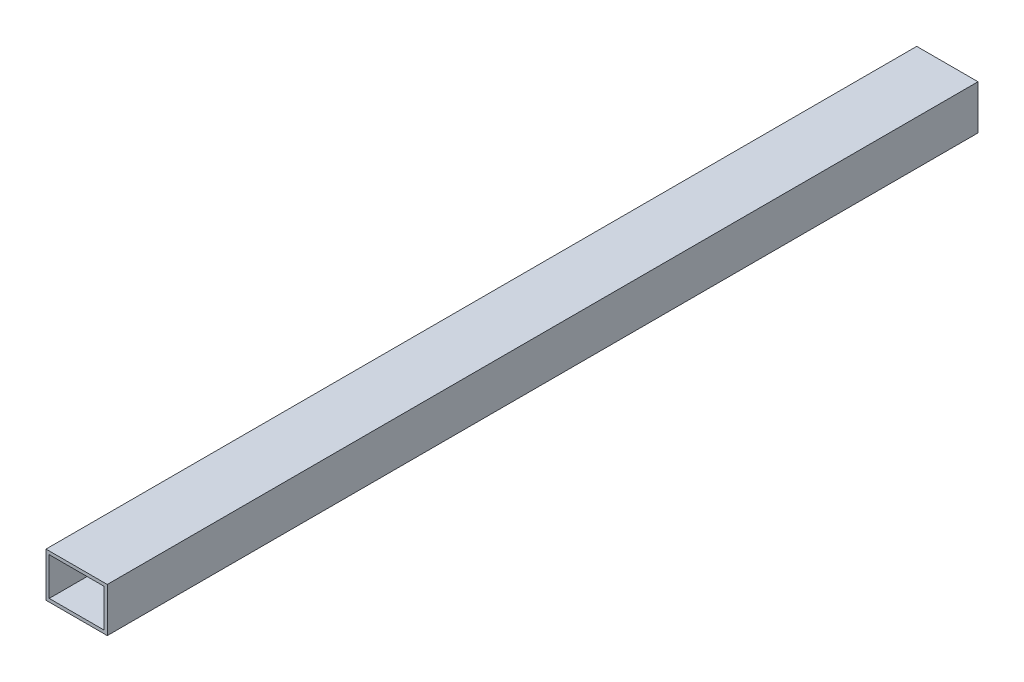
ISO-10303-21;
HEADER;
FILE_DESCRIPTION(('STEP AP214'),'2;1');
FILE_NAME('part.step','',(''),(''),'','','');
FILE_SCHEMA(('AUTOMOTIVE_DESIGN { 1 0 10303 214 1 1 1 1 }'));
ENDSEC;
DATA;
#1=APPLICATION_CONTEXT('core data for automotive mechanical design processes');
#2=APPLICATION_PROTOCOL_DEFINITION('international standard','automotive_design',2000,#1);
#3=PRODUCT_CONTEXT('',#1,'mechanical');
#4=PRODUCT('Part','Part','',(#3));
#5=PRODUCT_RELATED_PRODUCT_CATEGORY('part','',(#4));
#6=PRODUCT_DEFINITION_FORMATION('','',#4);
#7=PRODUCT_DEFINITION_CONTEXT('part definition',#1,'design');
#8=PRODUCT_DEFINITION('design','',#6,#7);
#9=PRODUCT_DEFINITION_SHAPE('','',#8);
#10=(LENGTH_UNIT() NAMED_UNIT(*) SI_UNIT(.MILLI.,.METRE.));
#11=(NAMED_UNIT(*) PLANE_ANGLE_UNIT() SI_UNIT($,.RADIAN.));
#12=(NAMED_UNIT(*) SI_UNIT($,.STERADIAN.) SOLID_ANGLE_UNIT());
#13=UNCERTAINTY_MEASURE_WITH_UNIT(LENGTH_MEASURE(1.E-05),#10,'distance_accuracy_value','');
#14=(GEOMETRIC_REPRESENTATION_CONTEXT(3) GLOBAL_UNCERTAINTY_ASSIGNED_CONTEXT((#13)) GLOBAL_UNIT_ASSIGNED_CONTEXT((#10,
#11,#12)) REPRESENTATION_CONTEXT('',''));
#15=CARTESIAN_POINT('',(0.,0.,0.));
#16=DIRECTION('',(0.,0.,1.));
#17=DIRECTION('',(1.,0.,0.));
#18=AXIS2_PLACEMENT_3D('',#15,#16,#17);
#19=CARTESIAN_POINT('',(0.,0.,540.));
#20=DIRECTION('',(0.,0.,1.));
#21=DIRECTION('',(1.,0.,0.));
#22=AXIS2_PLACEMENT_3D('',#19,#20,#21);
#23=PLANE('',#22);
#24=DIRECTION('',(0.,-1.,0.));
#25=VECTOR('',#24,1.);
#26=CARTESIAN_POINT('',(-34.9065842427437,29.0670168797834,540.));
#27=LINE('',#26,#25);
#28=CARTESIAN_POINT('',(-34.9065842427437,29.0670168797834,540.));
#29=VERTEX_POINT('',#28);
#30=CARTESIAN_POINT('',(-34.9065842427437,1.56701687978338,540.));
#31=VERTEX_POINT('',#30);
#32=EDGE_CURVE('E153',#29,#31,#27,.T.);
#33=ORIENTED_EDGE('',*,*,#32,.T.);
#34=DIRECTION('',(1.,0.,0.));
#35=VECTOR('',#34,1.);
#36=CARTESIAN_POINT('',(-34.9065842427437,1.56701687978338,540.));
#37=LINE('',#36,#35);
#38=CARTESIAN_POINT('',(3.09341575725631,1.56701687978338,540.));
#39=VERTEX_POINT('',#38);
#40=EDGE_CURVE('E157',#31,#39,#37,.T.);
#41=ORIENTED_EDGE('',*,*,#40,.T.);
#42=DIRECTION('',(0.,1.,0.));
#43=VECTOR('',#42,1.);
#44=CARTESIAN_POINT('',(3.0934157572563,29.0670168797834,540.));
#45=LINE('',#44,#43);
#46=CARTESIAN_POINT('',(3.0934157572563,29.0670168797834,540.));
#47=VERTEX_POINT('',#46);
#48=EDGE_CURVE('E161',#39,#47,#45,.T.);
#49=ORIENTED_EDGE('',*,*,#48,.T.);
#50=DIRECTION('',(-1.,0.,0.));
#51=VECTOR('',#50,1.);
#52=CARTESIAN_POINT('',(-34.9065842427437,29.0670168797834,540.));
#53=LINE('',#52,#51);
#54=EDGE_CURVE('E164',#47,#29,#53,.T.);
#55=ORIENTED_EDGE('',*,*,#54,.T.);
#56=EDGE_LOOP('',(#33,#41,#49,#55));
#57=FACE_BOUND('',#56,.T.);
#58=DIRECTION('',(1.,0.,0.));
#59=VECTOR('',#58,1.);
#60=CARTESIAN_POINT('',(-32.9065842427437,3.56701687978338,540.));
#61=LINE('',#60,#59);
#62=CARTESIAN_POINT('',(-32.9065842427437,3.56701687978338,540.));
#63=VERTEX_POINT('',#62);
#64=CARTESIAN_POINT('',(1.09341575725631,3.56701687978338,540.));
#65=VERTEX_POINT('',#64);
#66=EDGE_CURVE('E114',#63,#65,#61,.T.);
#67=ORIENTED_EDGE('',*,*,#66,.F.);
#68=DIRECTION('',(0.,-1.,0.));
#69=VECTOR('',#68,1.);
#70=CARTESIAN_POINT('',(-32.9065842427437,27.0670168797834,540.));
#71=LINE('',#70,#69);
#72=CARTESIAN_POINT('',(-32.9065842427437,27.0670168797834,540.));
#73=VERTEX_POINT('',#72);
#74=EDGE_CURVE('E105',#73,#63,#71,.T.);
#75=ORIENTED_EDGE('',*,*,#74,.F.);
#76=DIRECTION('',(-1.,0.,0.));
#77=VECTOR('',#76,1.);
#78=CARTESIAN_POINT('',(-32.9065842427437,27.0670168797834,540.));
#79=LINE('',#78,#77);
#80=CARTESIAN_POINT('',(1.09341575725631,27.0670168797834,540.));
#81=VERTEX_POINT('',#80);
#82=EDGE_CURVE('E131',#81,#73,#79,.T.);
#83=ORIENTED_EDGE('',*,*,#82,.F.);
#84=DIRECTION('',(0.,1.,0.));
#85=VECTOR('',#84,1.);
#86=CARTESIAN_POINT('',(1.09341575725631,27.0670168797834,540.));
#87=LINE('',#86,#85);
#88=EDGE_CURVE('E127',#65,#81,#87,.T.);
#89=ORIENTED_EDGE('',*,*,#88,.F.);
#90=EDGE_LOOP('',(#67,#75,#83,#89));
#91=FACE_BOUND('',#90,.T.);
#92=ADVANCED_FACE('F39',(#57,#91),#23,.T.);
#93=CARTESIAN_POINT('',(0.,0.,0.));
#94=DIRECTION('',(0.,0.,1.));
#95=DIRECTION('',(1.,0.,0.));
#96=AXIS2_PLACEMENT_3D('',#93,#94,#95);
#97=PLANE('',#96);
#98=DIRECTION('',(0.,-1.,0.));
#99=VECTOR('',#98,1.);
#100=CARTESIAN_POINT('',(-34.9065842427437,29.0670168797834,0.));
#101=LINE('',#100,#99);
#102=CARTESIAN_POINT('',(-34.9065842427437,29.0670168797834,0.));
#103=VERTEX_POINT('',#102);
#104=CARTESIAN_POINT('',(-34.9065842427437,1.56701687978338,0.));
#105=VERTEX_POINT('',#104);
#106=EDGE_CURVE('E123',#103,#105,#101,.T.);
#107=ORIENTED_EDGE('',*,*,#106,.F.);
#108=DIRECTION('',(-1.,0.,0.));
#109=VECTOR('',#108,1.);
#110=CARTESIAN_POINT('',(-34.9065842427437,29.0670168797834,0.));
#111=LINE('',#110,#109);
#112=CARTESIAN_POINT('',(3.0934157572563,29.0670168797834,0.));
#113=VERTEX_POINT('',#112);
#114=EDGE_CURVE('E158',#113,#103,#111,.T.);
#115=ORIENTED_EDGE('',*,*,#114,.F.);
#116=DIRECTION('',(0.,1.,0.));
#117=VECTOR('',#116,1.);
#118=CARTESIAN_POINT('',(3.0934157572563,29.0670168797834,0.));
#119=LINE('',#118,#117);
#120=CARTESIAN_POINT('',(3.09341575725631,1.56701687978338,0.));
#121=VERTEX_POINT('',#120);
#122=EDGE_CURVE('E174',#121,#113,#119,.T.);
#123=ORIENTED_EDGE('',*,*,#122,.F.);
#124=DIRECTION('',(1.,0.,0.));
#125=VECTOR('',#124,1.);
#126=CARTESIAN_POINT('',(-34.9065842427437,1.56701687978338,0.));
#127=LINE('',#126,#125);
#128=EDGE_CURVE('E171',#105,#121,#127,.T.);
#129=ORIENTED_EDGE('',*,*,#128,.F.);
#130=EDGE_LOOP('',(#107,#115,#123,#129));
#131=FACE_BOUND('',#130,.T.);
#132=DIRECTION('',(0.,-1.,0.));
#133=VECTOR('',#132,1.);
#134=CARTESIAN_POINT('',(-32.9065842427437,27.0670168797834,0.));
#135=LINE('',#134,#133);
#136=CARTESIAN_POINT('',(-32.9065842427437,27.0670168797834,0.));
#137=VERTEX_POINT('',#136);
#138=CARTESIAN_POINT('',(-32.9065842427437,3.56701687978338,0.));
#139=VERTEX_POINT('',#138);
#140=EDGE_CURVE('E63',#137,#139,#135,.T.);
#141=ORIENTED_EDGE('',*,*,#140,.T.);
#142=DIRECTION('',(1.,0.,0.));
#143=VECTOR('',#142,1.);
#144=CARTESIAN_POINT('',(-32.9065842427437,3.56701687978338,0.));
#145=LINE('',#144,#143);
#146=CARTESIAN_POINT('',(1.09341575725631,3.56701687978338,0.));
#147=VERTEX_POINT('',#146);
#148=EDGE_CURVE('E121',#139,#147,#145,.T.);
#149=ORIENTED_EDGE('',*,*,#148,.T.);
#150=DIRECTION('',(0.,1.,0.));
#151=VECTOR('',#150,1.);
#152=CARTESIAN_POINT('',(1.09341575725631,27.0670168797834,0.));
#153=LINE('',#152,#151);
#154=CARTESIAN_POINT('',(1.09341575725631,27.0670168797834,0.));
#155=VERTEX_POINT('',#154);
#156=EDGE_CURVE('E140',#147,#155,#153,.T.);
#157=ORIENTED_EDGE('',*,*,#156,.T.);
#158=DIRECTION('',(-1.,0.,0.));
#159=VECTOR('',#158,1.);
#160=CARTESIAN_POINT('',(-32.9065842427437,27.0670168797834,0.));
#161=LINE('',#160,#159);
#162=EDGE_CURVE('E115',#155,#137,#161,.T.);
#163=ORIENTED_EDGE('',*,*,#162,.T.);
#164=EDGE_LOOP('',(#141,#149,#157,#163));
#165=FACE_BOUND('',#164,.T.);
#166=ADVANCED_FACE('F197',(#131,#165),#97,.F.);
#167=CARTESIAN_POINT('',(-34.9065842427437,29.0670168797834,540.));
#168=DIRECTION('',(1.,0.,0.));
#169=DIRECTION('',(0.,0.,-1.));
#170=AXIS2_PLACEMENT_3D('',#167,#168,#169);
#171=PLANE('',#170);
#172=ORIENTED_EDGE('',*,*,#106,.T.);
#173=DIRECTION('',(0.,0.,-1.));
#174=VECTOR('',#173,1.);
#175=CARTESIAN_POINT('',(-34.9065842427437,1.56701687978338,540.));
#176=LINE('',#175,#174);
#177=EDGE_CURVE('E11',#31,#105,#176,.T.);
#178=ORIENTED_EDGE('',*,*,#177,.F.);
#179=ORIENTED_EDGE('',*,*,#32,.F.);
#180=DIRECTION('',(0.,0.,-1.));
#181=VECTOR('',#180,1.);
#182=CARTESIAN_POINT('',(-34.9065842427437,29.0670168797834,540.));
#183=LINE('',#182,#181);
#184=EDGE_CURVE('E167',#29,#103,#183,.T.);
#185=ORIENTED_EDGE('',*,*,#184,.T.);
#186=EDGE_LOOP('',(#172,#178,#179,#185));
#187=FACE_BOUND('',#186,.T.);
#188=ADVANCED_FACE('F41',(#187),#171,.F.);
#189=CARTESIAN_POINT('',(-34.9065842427437,1.56701687978338,540.));
#190=DIRECTION('',(0.,1.,0.));
#191=DIRECTION('',(-1.,0.,0.));
#192=AXIS2_PLACEMENT_3D('',#189,#190,#191);
#193=PLANE('',#192);
#194=ORIENTED_EDGE('',*,*,#128,.T.);
#195=DIRECTION('',(0.,0.,-1.));
#196=VECTOR('',#195,1.);
#197=CARTESIAN_POINT('',(3.09341575725631,1.56701687978338,540.));
#198=LINE('',#197,#196);
#199=EDGE_CURVE('E48',#39,#121,#198,.T.);
#200=ORIENTED_EDGE('',*,*,#199,.F.);
#201=ORIENTED_EDGE('',*,*,#40,.F.);
#202=ORIENTED_EDGE('',*,*,#177,.T.);
#203=EDGE_LOOP('',(#194,#200,#201,#202));
#204=FACE_BOUND('',#203,.T.);
#205=ADVANCED_FACE('F207',(#204),#193,.F.);
#206=CARTESIAN_POINT('',(3.0934157572563,29.0670168797834,540.));
#207=DIRECTION('',(-1.,0.,0.));
#208=DIRECTION('',(0.,-1.,0.));
#209=AXIS2_PLACEMENT_3D('',#206,#207,#208);
#210=PLANE('',#209);
#211=ORIENTED_EDGE('',*,*,#122,.T.);
#212=DIRECTION('',(0.,0.,-1.));
#213=VECTOR('',#212,1.);
#214=CARTESIAN_POINT('',(3.0934157572563,29.0670168797834,540.));
#215=LINE('',#214,#213);
#216=EDGE_CURVE('E182',#47,#113,#215,.T.);
#217=ORIENTED_EDGE('',*,*,#216,.F.);
#218=ORIENTED_EDGE('',*,*,#48,.F.);
#219=ORIENTED_EDGE('',*,*,#199,.T.);
#220=EDGE_LOOP('',(#211,#217,#218,#219));
#221=FACE_BOUND('',#220,.T.);
#222=ADVANCED_FACE('F191',(#221),#210,.F.);
#223=CARTESIAN_POINT('',(-34.9065842427437,29.0670168797834,540.));
#224=DIRECTION('',(0.,-1.,0.));
#225=DIRECTION('',(1.,0.,0.));
#226=AXIS2_PLACEMENT_3D('',#223,#224,#225);
#227=PLANE('',#226);
#228=ORIENTED_EDGE('',*,*,#114,.T.);
#229=ORIENTED_EDGE('',*,*,#184,.F.);
#230=ORIENTED_EDGE('',*,*,#54,.F.);
#231=ORIENTED_EDGE('',*,*,#216,.T.);
#232=EDGE_LOOP('',(#228,#229,#230,#231));
#233=FACE_BOUND('',#232,.T.);
#234=ADVANCED_FACE('F201',(#233),#227,.F.);
#235=CARTESIAN_POINT('',(-32.9065842427437,27.0670168797834,540.));
#236=DIRECTION('',(1.,0.,0.));
#237=DIRECTION('',(0.,0.,-1.));
#238=AXIS2_PLACEMENT_3D('',#235,#236,#237);
#239=PLANE('',#238);
#240=ORIENTED_EDGE('',*,*,#140,.F.);
#241=DIRECTION('',(0.,0.,-1.));
#242=VECTOR('',#241,1.);
#243=CARTESIAN_POINT('',(-32.9065842427437,27.0670168797834,540.));
#244=LINE('',#243,#242);
#245=EDGE_CURVE('E109',#73,#137,#244,.T.);
#246=ORIENTED_EDGE('',*,*,#245,.F.);
#247=ORIENTED_EDGE('',*,*,#74,.T.);
#248=DIRECTION('',(0.,0.,-1.));
#249=VECTOR('',#248,1.);
#250=CARTESIAN_POINT('',(-32.9065842427437,3.56701687978338,540.));
#251=LINE('',#250,#249);
#252=EDGE_CURVE('E108',#63,#139,#251,.T.);
#253=ORIENTED_EDGE('',*,*,#252,.T.);
#254=EDGE_LOOP('',(#240,#246,#247,#253));
#255=FACE_BOUND('',#254,.T.);
#256=ADVANCED_FACE('F107',(#255),#239,.T.);
#257=CARTESIAN_POINT('',(-32.9065842427437,3.56701687978338,540.));
#258=DIRECTION('',(0.,1.,0.));
#259=DIRECTION('',(0.,0.,1.));
#260=AXIS2_PLACEMENT_3D('',#257,#258,#259);
#261=PLANE('',#260);
#262=ORIENTED_EDGE('',*,*,#148,.F.);
#263=ORIENTED_EDGE('',*,*,#252,.F.);
#264=ORIENTED_EDGE('',*,*,#66,.T.);
#265=DIRECTION('',(0.,0.,-1.));
#266=VECTOR('',#265,1.);
#267=CARTESIAN_POINT('',(1.09341575725631,3.56701687978338,540.));
#268=LINE('',#267,#266);
#269=EDGE_CURVE('E124',#65,#147,#268,.T.);
#270=ORIENTED_EDGE('',*,*,#269,.T.);
#271=EDGE_LOOP('',(#262,#263,#264,#270));
#272=FACE_BOUND('',#271,.T.);
#273=ADVANCED_FACE('F118',(#272),#261,.T.);
#274=CARTESIAN_POINT('',(1.09341575725631,27.0670168797834,540.));
#275=DIRECTION('',(-1.,0.,0.));
#276=DIRECTION('',(0.,-1.,0.));
#277=AXIS2_PLACEMENT_3D('',#274,#275,#276);
#278=PLANE('',#277);
#279=ORIENTED_EDGE('',*,*,#156,.F.);
#280=ORIENTED_EDGE('',*,*,#269,.F.);
#281=ORIENTED_EDGE('',*,*,#88,.T.);
#282=DIRECTION('',(0.,0.,-1.));
#283=VECTOR('',#282,1.);
#284=CARTESIAN_POINT('',(1.09341575725631,27.0670168797834,540.));
#285=LINE('',#284,#283);
#286=EDGE_CURVE('E55',#81,#155,#285,.T.);
#287=ORIENTED_EDGE('',*,*,#286,.T.);
#288=EDGE_LOOP('',(#279,#280,#281,#287));
#289=FACE_BOUND('',#288,.T.);
#290=ADVANCED_FACE('F230',(#289),#278,.T.);
#291=CARTESIAN_POINT('',(-32.9065842427437,27.0670168797834,540.));
#292=DIRECTION('',(0.,-1.,0.));
#293=DIRECTION('',(1.,0.,0.));
#294=AXIS2_PLACEMENT_3D('',#291,#292,#293);
#295=PLANE('',#294);
#296=ORIENTED_EDGE('',*,*,#162,.F.);
#297=ORIENTED_EDGE('',*,*,#286,.F.);
#298=ORIENTED_EDGE('',*,*,#82,.T.);
#299=ORIENTED_EDGE('',*,*,#245,.T.);
#300=EDGE_LOOP('',(#296,#297,#298,#299));
#301=FACE_BOUND('',#300,.T.);
#302=ADVANCED_FACE('F234',(#301),#295,.T.);
#303=CLOSED_SHELL('',(#92,#166,#188,#205,#222,#234,#256,#273,#290,#302));
#304=MANIFOLD_SOLID_BREP('B2',#303);
#305=ADVANCED_BREP_SHAPE_REPRESENTATION('',(#18,#304),#14);
#306=SHAPE_DEFINITION_REPRESENTATION(#9,#305);
ENDSEC;
END-ISO-10303-21;
